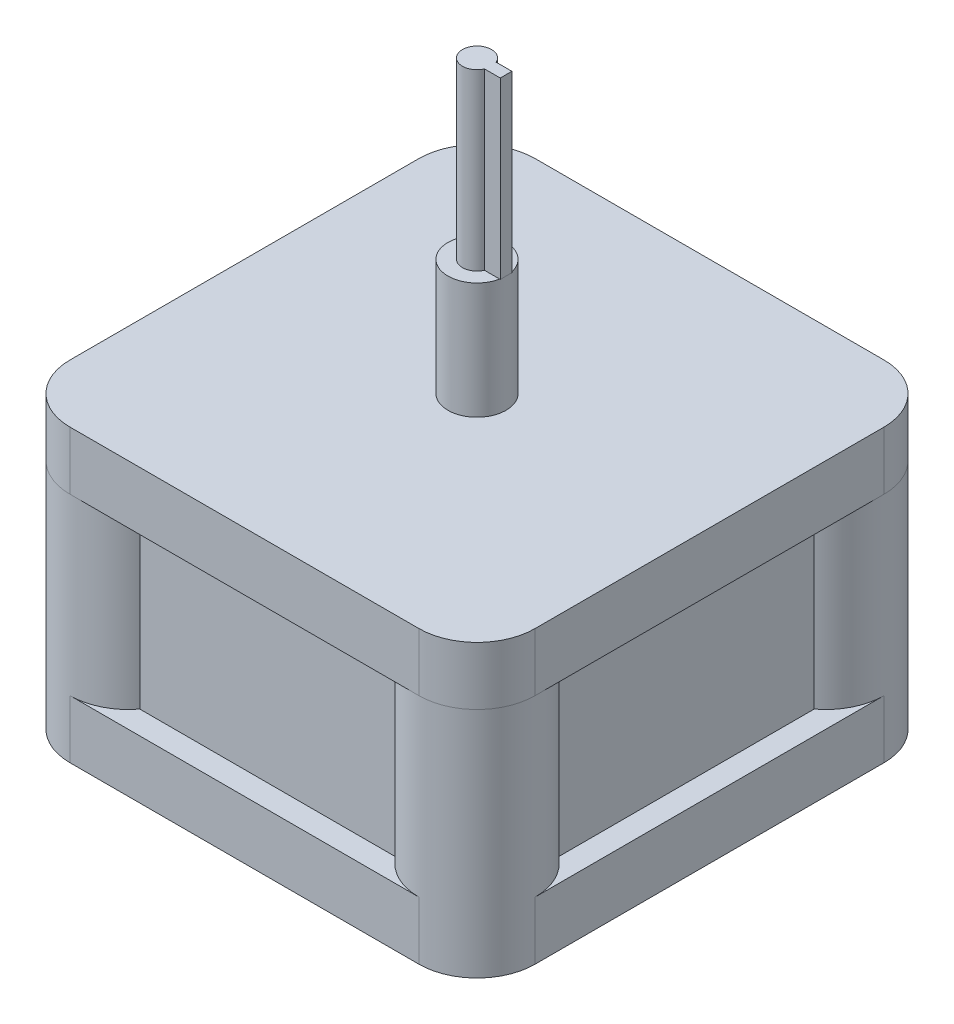
ISO-10303-21;
HEADER;
FILE_DESCRIPTION(('STEP AP214'),'2;1');
FILE_NAME('part.step','',(''),(''),'','','');
FILE_SCHEMA(('AUTOMOTIVE_DESIGN { 1 0 10303 214 1 1 1 1 }'));
ENDSEC;
DATA;
#1=APPLICATION_CONTEXT('core data for automotive mechanical design processes');
#2=APPLICATION_PROTOCOL_DEFINITION('international standard','automotive_design',2000,#1);
#3=PRODUCT_CONTEXT('',#1,'mechanical');
#4=PRODUCT('Part','Part','',(#3));
#5=PRODUCT_RELATED_PRODUCT_CATEGORY('part','',(#4));
#6=PRODUCT_DEFINITION_FORMATION('','',#4);
#7=PRODUCT_DEFINITION_CONTEXT('part definition',#1,'design');
#8=PRODUCT_DEFINITION('design','',#6,#7);
#9=PRODUCT_DEFINITION_SHAPE('','',#8);
#10=(LENGTH_UNIT() NAMED_UNIT(*) SI_UNIT(.MILLI.,.METRE.));
#11=(NAMED_UNIT(*) PLANE_ANGLE_UNIT() SI_UNIT($,.RADIAN.));
#12=(NAMED_UNIT(*) SI_UNIT($,.STERADIAN.) SOLID_ANGLE_UNIT());
#13=UNCERTAINTY_MEASURE_WITH_UNIT(LENGTH_MEASURE(1.E-05),#10,'distance_accuracy_value','');
#14=(GEOMETRIC_REPRESENTATION_CONTEXT(3) GLOBAL_UNCERTAINTY_ASSIGNED_CONTEXT((#13)) GLOBAL_UNIT_ASSIGNED_CONTEXT((#10,
#11,#12)) REPRESENTATION_CONTEXT('',''));
#15=CARTESIAN_POINT('',(0.,0.,0.));
#16=DIRECTION('',(0.,0.,1.));
#17=DIRECTION('',(1.,0.,0.));
#18=AXIS2_PLACEMENT_3D('',#15,#16,#17);
#19=CARTESIAN_POINT('',(0.,6.35,0.));
#20=DIRECTION('',(0.,-1.,0.));
#21=DIRECTION('',(0.,0.,-1.));
#22=AXIS2_PLACEMENT_3D('',#19,#20,#21);
#23=PLANE('',#22);
#24=CARTESIAN_POINT('',(44.45,6.35,-44.45));
#25=DIRECTION('',(0.,1.,0.));
#26=DIRECTION('',(0.,0.,1.));
#27=AXIS2_PLACEMENT_3D('',#24,#25,#26);
#28=CIRCLE('',#27,6.35);
#29=CARTESIAN_POINT('',(48.26,6.35,-39.37));
#30=VERTEX_POINT('',#29);
#31=CARTESIAN_POINT('',(50.8,6.35,-44.45));
#32=VERTEX_POINT('',#31);
#33=EDGE_CURVE('E296',#30,#32,#28,.T.);
#34=ORIENTED_EDGE('',*,*,#33,.F.);
#35=DIRECTION('',(0.,0.,-1.));
#36=VECTOR('',#35,1.);
#37=CARTESIAN_POINT('',(48.26,6.35,-39.37));
#38=LINE('',#37,#36);
#39=CARTESIAN_POINT('',(48.26,6.35,-11.43));
#40=VERTEX_POINT('',#39);
#41=EDGE_CURVE('E382',#40,#30,#38,.T.);
#42=ORIENTED_EDGE('',*,*,#41,.F.);
#43=CARTESIAN_POINT('',(44.45,6.35,-6.35));
#44=DIRECTION('',(0.,1.,0.));
#45=DIRECTION('',(0.,0.,1.));
#46=AXIS2_PLACEMENT_3D('',#43,#44,#45);
#47=CIRCLE('',#46,6.35);
#48=CARTESIAN_POINT('',(50.8,6.35,-6.35));
#49=VERTEX_POINT('',#48);
#50=EDGE_CURVE('E383',#49,#40,#47,.T.);
#51=ORIENTED_EDGE('',*,*,#50,.F.);
#52=DIRECTION('',(0.,0.,-1.));
#53=VECTOR('',#52,1.);
#54=CARTESIAN_POINT('',(50.8,6.35,0.));
#55=LINE('',#54,#53);
#56=EDGE_CURVE('E428',#49,#32,#55,.T.);
#57=ORIENTED_EDGE('',*,*,#56,.T.);
#58=EDGE_LOOP('',(#34,#42,#51,#57));
#59=FACE_BOUND('',#58,.T.);
#60=ADVANCED_FACE('F43',(#59),#23,.F.);
#61=CARTESIAN_POINT('',(39.37,6.35,-2.54));
#62=VERTEX_POINT('',#61);
#63=CARTESIAN_POINT('',(44.45,6.35,0.));
#64=VERTEX_POINT('',#63);
#65=EDGE_CURVE('E378',#62,#64,#47,.T.);
#66=ORIENTED_EDGE('',*,*,#65,.F.);
#67=DIRECTION('',(1.,0.,0.));
#68=VECTOR('',#67,1.);
#69=CARTESIAN_POINT('',(11.43,6.35,-2.54));
#70=LINE('',#69,#68);
#71=CARTESIAN_POINT('',(11.43,6.35,-2.54));
#72=VERTEX_POINT('',#71);
#73=EDGE_CURVE('E373',#72,#62,#70,.T.);
#74=ORIENTED_EDGE('',*,*,#73,.F.);
#75=CARTESIAN_POINT('',(6.35,6.35,-6.35));
#76=DIRECTION('',(0.,1.,0.));
#77=DIRECTION('',(0.,0.,1.));
#78=AXIS2_PLACEMENT_3D('',#75,#76,#77);
#79=CIRCLE('',#78,6.35);
#80=CARTESIAN_POINT('',(6.35,6.35,0.));
#81=VERTEX_POINT('',#80);
#82=EDGE_CURVE('E374',#81,#72,#79,.T.);
#83=ORIENTED_EDGE('',*,*,#82,.F.);
#84=DIRECTION('',(1.,0.,0.));
#85=VECTOR('',#84,1.);
#86=CARTESIAN_POINT('',(0.,6.35,0.));
#87=LINE('',#86,#85);
#88=EDGE_CURVE('E423',#81,#64,#87,.T.);
#89=ORIENTED_EDGE('',*,*,#88,.T.);
#90=EDGE_LOOP('',(#66,#74,#83,#89));
#91=FACE_BOUND('',#90,.T.);
#92=ADVANCED_FACE('F625',(#91),#23,.F.);
#93=CARTESIAN_POINT('',(2.54,6.35,-11.43));
#94=VERTEX_POINT('',#93);
#95=CARTESIAN_POINT('',(0.,6.35,-6.35));
#96=VERTEX_POINT('',#95);
#97=EDGE_CURVE('E369',#94,#96,#79,.T.);
#98=ORIENTED_EDGE('',*,*,#97,.F.);
#99=DIRECTION('',(0.,0.,1.));
#100=VECTOR('',#99,1.);
#101=CARTESIAN_POINT('',(2.54,6.35,-39.37));
#102=LINE('',#101,#100);
#103=CARTESIAN_POINT('',(2.54,6.35,-39.37));
#104=VERTEX_POINT('',#103);
#105=EDGE_CURVE('E364',#104,#94,#102,.T.);
#106=ORIENTED_EDGE('',*,*,#105,.F.);
#107=CARTESIAN_POINT('',(6.35,6.35,-44.45));
#108=DIRECTION('',(0.,1.,0.));
#109=DIRECTION('',(0.,0.,1.));
#110=AXIS2_PLACEMENT_3D('',#107,#108,#109);
#111=CIRCLE('',#110,6.35);
#112=CARTESIAN_POINT('',(0.,6.35,-44.45));
#113=VERTEX_POINT('',#112);
#114=EDGE_CURVE('E365',#113,#104,#111,.T.);
#115=ORIENTED_EDGE('',*,*,#114,.F.);
#116=DIRECTION('',(0.,0.,1.));
#117=VECTOR('',#116,1.);
#118=CARTESIAN_POINT('',(0.,6.35,0.));
#119=LINE('',#118,#117);
#120=EDGE_CURVE('E419',#113,#96,#119,.T.);
#121=ORIENTED_EDGE('',*,*,#120,.T.);
#122=EDGE_LOOP('',(#98,#106,#115,#121));
#123=FACE_BOUND('',#122,.T.);
#124=ADVANCED_FACE('F643',(#123),#23,.F.);
#125=CARTESIAN_POINT('',(44.45,6.35,-50.8));
#126=VERTEX_POINT('',#125);
#127=CARTESIAN_POINT('',(39.37,6.35,-48.26));
#128=VERTEX_POINT('',#127);
#129=EDGE_CURVE('E356',#126,#128,#28,.T.);
#130=ORIENTED_EDGE('',*,*,#129,.F.);
#131=DIRECTION('',(-1.,0.,0.));
#132=VECTOR('',#131,1.);
#133=CARTESIAN_POINT('',(0.,6.35,-50.8));
#134=LINE('',#133,#132);
#135=CARTESIAN_POINT('',(6.35,6.35,-50.8));
#136=VERTEX_POINT('',#135);
#137=EDGE_CURVE('E432',#126,#136,#134,.T.);
#138=ORIENTED_EDGE('',*,*,#137,.T.);
#139=CARTESIAN_POINT('',(11.43,6.35,-48.26));
#140=VERTEX_POINT('',#139);
#141=EDGE_CURVE('E360',#140,#136,#111,.T.);
#142=ORIENTED_EDGE('',*,*,#141,.F.);
#143=DIRECTION('',(-1.,0.,0.));
#144=VECTOR('',#143,1.);
#145=CARTESIAN_POINT('',(11.43,6.35,-48.26));
#146=LINE('',#145,#144);
#147=EDGE_CURVE('E355',#128,#140,#146,.T.);
#148=ORIENTED_EDGE('',*,*,#147,.F.);
#149=EDGE_LOOP('',(#130,#138,#142,#148));
#150=FACE_BOUND('',#149,.T.);
#151=ADVANCED_FACE('F641',(#150),#23,.F.);
#152=CARTESIAN_POINT('',(0.,6.35,0.));
#153=DIRECTION('',(1.,0.,0.));
#154=DIRECTION('',(0.,0.,-1.));
#155=AXIS2_PLACEMENT_3D('',#152,#153,#154);
#156=PLANE('',#155);
#157=ORIENTED_EDGE('',*,*,#120,.F.);
#158=DIRECTION('',(0.,-1.,0.));
#159=VECTOR('',#158,1.);
#160=CARTESIAN_POINT('',(0.,6.35,-44.45));
#161=LINE('',#160,#159);
#162=CARTESIAN_POINT('',(0.,0.,-44.45));
#163=VERTEX_POINT('',#162);
#164=EDGE_CURVE('E453',#113,#163,#161,.T.);
#165=ORIENTED_EDGE('',*,*,#164,.T.);
#166=DIRECTION('',(0.,0.,1.));
#167=VECTOR('',#166,1.);
#168=CARTESIAN_POINT('',(0.,0.,0.));
#169=LINE('',#168,#167);
#170=CARTESIAN_POINT('',(0.,0.,-6.35));
#171=VERTEX_POINT('',#170);
#172=EDGE_CURVE('E418',#163,#171,#169,.T.);
#173=ORIENTED_EDGE('',*,*,#172,.T.);
#174=DIRECTION('',(0.,-1.,0.));
#175=VECTOR('',#174,1.);
#176=CARTESIAN_POINT('',(0.,6.35,-6.35));
#177=LINE('',#176,#175);
#178=EDGE_CURVE('E436',#171,#96,#177,.F.);
#179=ORIENTED_EDGE('',*,*,#178,.T.);
#180=EDGE_LOOP('',(#157,#165,#173,#179));
#181=FACE_BOUND('',#180,.T.);
#182=ADVANCED_FACE('F636',(#181),#156,.F.);
#183=CARTESIAN_POINT('',(0.,6.35,0.));
#184=DIRECTION('',(0.,0.,-1.));
#185=DIRECTION('',(-1.,0.,0.));
#186=AXIS2_PLACEMENT_3D('',#183,#184,#185);
#187=PLANE('',#186);
#188=DIRECTION('',(1.,0.,0.));
#189=VECTOR('',#188,1.);
#190=CARTESIAN_POINT('',(0.,0.,0.));
#191=LINE('',#190,#189);
#192=CARTESIAN_POINT('',(6.35,0.,0.));
#193=VERTEX_POINT('',#192);
#194=CARTESIAN_POINT('',(44.45,0.,0.));
#195=VERTEX_POINT('',#194);
#196=EDGE_CURVE('E440',#193,#195,#191,.T.);
#197=ORIENTED_EDGE('',*,*,#196,.T.);
#198=DIRECTION('',(0.,-1.,0.));
#199=VECTOR('',#198,1.);
#200=CARTESIAN_POINT('',(44.45,6.35,0.));
#201=LINE('',#200,#199);
#202=EDGE_CURVE('E487',#195,#64,#201,.F.);
#203=ORIENTED_EDGE('',*,*,#202,.T.);
#204=ORIENTED_EDGE('',*,*,#88,.F.);
#205=DIRECTION('',(0.,-1.,0.));
#206=VECTOR('',#205,1.);
#207=CARTESIAN_POINT('',(6.35,6.35,0.));
#208=LINE('',#207,#206);
#209=EDGE_CURVE('E483',#81,#193,#208,.T.);
#210=ORIENTED_EDGE('',*,*,#209,.T.);
#211=EDGE_LOOP('',(#197,#203,#204,#210));
#212=FACE_BOUND('',#211,.T.);
#213=ADVANCED_FACE('F628',(#212),#187,.F.);
#214=CARTESIAN_POINT('',(50.8,6.35,0.));
#215=DIRECTION('',(-1.,0.,0.));
#216=DIRECTION('',(0.,0.,1.));
#217=AXIS2_PLACEMENT_3D('',#214,#215,#216);
#218=PLANE('',#217);
#219=DIRECTION('',(0.,0.,-1.));
#220=VECTOR('',#219,1.);
#221=CARTESIAN_POINT('',(50.8,0.,0.));
#222=LINE('',#221,#220);
#223=CARTESIAN_POINT('',(50.8,0.,-6.35));
#224=VERTEX_POINT('',#223);
#225=CARTESIAN_POINT('',(50.8,0.,-44.45));
#226=VERTEX_POINT('',#225);
#227=EDGE_CURVE('E444',#224,#226,#222,.T.);
#228=ORIENTED_EDGE('',*,*,#227,.T.);
#229=DIRECTION('',(0.,-1.,0.));
#230=VECTOR('',#229,1.);
#231=CARTESIAN_POINT('',(50.8,6.35,-44.45));
#232=LINE('',#231,#230);
#233=EDGE_CURVE('E480',#226,#32,#232,.F.);
#234=ORIENTED_EDGE('',*,*,#233,.T.);
#235=ORIENTED_EDGE('',*,*,#56,.F.);
#236=DIRECTION('',(0.,-1.,0.));
#237=VECTOR('',#236,1.);
#238=CARTESIAN_POINT('',(50.8,6.35,-6.35));
#239=LINE('',#238,#237);
#240=EDGE_CURVE('E476',#49,#224,#239,.T.);
#241=ORIENTED_EDGE('',*,*,#240,.T.);
#242=EDGE_LOOP('',(#228,#234,#235,#241));
#243=FACE_BOUND('',#242,.T.);
#244=ADVANCED_FACE('F684',(#243),#218,.F.);
#245=CARTESIAN_POINT('',(0.,6.35,-50.8));
#246=DIRECTION('',(0.,0.,1.));
#247=DIRECTION('',(1.,0.,0.));
#248=AXIS2_PLACEMENT_3D('',#245,#246,#247);
#249=PLANE('',#248);
#250=DIRECTION('',(-1.,0.,0.));
#251=VECTOR('',#250,1.);
#252=CARTESIAN_POINT('',(0.,0.,-50.8));
#253=LINE('',#252,#251);
#254=CARTESIAN_POINT('',(44.45,0.,-50.8));
#255=VERTEX_POINT('',#254);
#256=CARTESIAN_POINT('',(6.35,0.,-50.8));
#257=VERTEX_POINT('',#256);
#258=EDGE_CURVE('E424',#255,#257,#253,.T.);
#259=ORIENTED_EDGE('',*,*,#258,.T.);
#260=DIRECTION('',(0.,-1.,0.));
#261=VECTOR('',#260,1.);
#262=CARTESIAN_POINT('',(6.35,6.35,-50.8));
#263=LINE('',#262,#261);
#264=EDGE_CURVE('E473',#257,#136,#263,.F.);
#265=ORIENTED_EDGE('',*,*,#264,.T.);
#266=ORIENTED_EDGE('',*,*,#137,.F.);
#267=DIRECTION('',(0.,-1.,0.));
#268=VECTOR('',#267,1.);
#269=CARTESIAN_POINT('',(44.45,6.35,-50.8));
#270=LINE('',#269,#268);
#271=EDGE_CURVE('E469',#126,#255,#270,.T.);
#272=ORIENTED_EDGE('',*,*,#271,.T.);
#273=EDGE_LOOP('',(#259,#265,#266,#272));
#274=FACE_BOUND('',#273,.T.);
#275=ADVANCED_FACE('F640',(#274),#249,.F.);
#276=CARTESIAN_POINT('',(0.,0.,0.));
#277=DIRECTION('',(0.,-1.,0.));
#278=DIRECTION('',(0.,0.,-1.));
#279=AXIS2_PLACEMENT_3D('',#276,#277,#278);
#280=PLANE('',#279);
#281=ORIENTED_EDGE('',*,*,#172,.F.);
#282=CARTESIAN_POINT('',(6.35,0.,-44.45));
#283=DIRECTION('',(0.,-1.,0.));
#284=DIRECTION('',(0.,0.,-1.));
#285=AXIS2_PLACEMENT_3D('',#282,#283,#284);
#286=CIRCLE('',#285,6.35);
#287=EDGE_CURVE('E466',#163,#257,#286,.T.);
#288=ORIENTED_EDGE('',*,*,#287,.T.);
#289=ORIENTED_EDGE('',*,*,#258,.F.);
#290=CARTESIAN_POINT('',(44.45,0.,-44.45));
#291=DIRECTION('',(0.,-1.,0.));
#292=DIRECTION('',(0.,0.,-1.));
#293=AXIS2_PLACEMENT_3D('',#290,#291,#292);
#294=CIRCLE('',#293,6.35);
#295=EDGE_CURVE('E463',#255,#226,#294,.T.);
#296=ORIENTED_EDGE('',*,*,#295,.T.);
#297=ORIENTED_EDGE('',*,*,#227,.F.);
#298=CARTESIAN_POINT('',(44.45,0.,-6.35));
#299=DIRECTION('',(0.,-1.,0.));
#300=DIRECTION('',(0.,0.,-1.));
#301=AXIS2_PLACEMENT_3D('',#298,#299,#300);
#302=CIRCLE('',#301,6.35);
#303=EDGE_CURVE('E460',#224,#195,#302,.T.);
#304=ORIENTED_EDGE('',*,*,#303,.T.);
#305=ORIENTED_EDGE('',*,*,#196,.F.);
#306=CARTESIAN_POINT('',(6.35,0.,-6.35));
#307=DIRECTION('',(0.,-1.,0.));
#308=DIRECTION('',(0.,0.,-1.));
#309=AXIS2_PLACEMENT_3D('',#306,#307,#308);
#310=CIRCLE('',#309,6.35);
#311=EDGE_CURVE('E457',#193,#171,#310,.T.);
#312=ORIENTED_EDGE('',*,*,#311,.T.);
#313=EDGE_LOOP('',(#281,#288,#289,#296,#297,#304,#305,#312));
#314=FACE_BOUND('',#313,.T.);
#315=ADVANCED_FACE('F633',(#314),#280,.T.);
#316=CARTESIAN_POINT('',(6.35,6.35,-44.45));
#317=DIRECTION('',(0.,-1.,0.));
#318=DIRECTION('',(0.,0.,-1.));
#319=AXIS2_PLACEMENT_3D('',#316,#317,#318);
#320=CYLINDRICAL_SURFACE('',#319,6.35);
#321=ORIENTED_EDGE('',*,*,#164,.F.);
#322=ORIENTED_EDGE('',*,*,#114,.T.);
#323=DIRECTION('',(0.,-1.,0.));
#324=VECTOR('',#323,1.);
#325=CARTESIAN_POINT('',(2.54,25.4,-39.37));
#326=LINE('',#325,#324);
#327=CARTESIAN_POINT('',(2.54,25.4,-39.37));
#328=VERTEX_POINT('',#327);
#329=EDGE_CURVE('E406',#328,#104,#326,.T.);
#330=ORIENTED_EDGE('',*,*,#329,.F.);
#331=CARTESIAN_POINT('',(6.35,25.4,-44.45));
#332=DIRECTION('',(0.,1.,0.));
#333=DIRECTION('',(0.,0.,1.));
#334=AXIS2_PLACEMENT_3D('',#331,#332,#333);
#335=CIRCLE('',#334,6.35);
#336=CARTESIAN_POINT('',(0.,25.4,-44.45));
#337=VERTEX_POINT('',#336);
#338=EDGE_CURVE('E321',#337,#328,#335,.T.);
#339=ORIENTED_EDGE('',*,*,#338,.F.);
#340=CARTESIAN_POINT('',(6.35,25.4,-50.8));
#341=VERTEX_POINT('',#340);
#342=EDGE_CURVE('E327',#341,#337,#335,.T.);
#343=ORIENTED_EDGE('',*,*,#342,.F.);
#344=CARTESIAN_POINT('',(11.43,25.4,-48.26));
#345=VERTEX_POINT('',#344);
#346=EDGE_CURVE('E322',#345,#341,#335,.T.);
#347=ORIENTED_EDGE('',*,*,#346,.F.);
#348=DIRECTION('',(0.,-1.,0.));
#349=VECTOR('',#348,1.);
#350=CARTESIAN_POINT('',(11.43,25.4,-48.26));
#351=LINE('',#350,#349);
#352=EDGE_CURVE('E410',#345,#140,#351,.T.);
#353=ORIENTED_EDGE('',*,*,#352,.T.);
#354=ORIENTED_EDGE('',*,*,#141,.T.);
#355=ORIENTED_EDGE('',*,*,#264,.F.);
#356=ORIENTED_EDGE('',*,*,#287,.F.);
#357=EDGE_LOOP('',(#321,#322,#330,#339,#343,#347,#353,#354,#355,#356));
#358=FACE_BOUND('',#357,.T.);
#359=ADVANCED_FACE('F607',(#358),#320,.T.);
#360=CARTESIAN_POINT('',(44.45,6.35,-44.45));
#361=DIRECTION('',(0.,-1.,0.));
#362=DIRECTION('',(0.,0.,-1.));
#363=AXIS2_PLACEMENT_3D('',#360,#361,#362);
#364=CYLINDRICAL_SURFACE('',#363,6.35);
#365=ORIENTED_EDGE('',*,*,#271,.F.);
#366=ORIENTED_EDGE('',*,*,#129,.T.);
#367=DIRECTION('',(0.,-1.,0.));
#368=VECTOR('',#367,1.);
#369=CARTESIAN_POINT('',(39.37,25.4,-48.26));
#370=LINE('',#369,#368);
#371=CARTESIAN_POINT('',(39.37,25.4,-48.26));
#372=VERTEX_POINT('',#371);
#373=EDGE_CURVE('E414',#372,#128,#370,.T.);
#374=ORIENTED_EDGE('',*,*,#373,.F.);
#375=CARTESIAN_POINT('',(44.45,25.4,-44.45));
#376=DIRECTION('',(0.,1.,0.));
#377=DIRECTION('',(0.,0.,1.));
#378=AXIS2_PLACEMENT_3D('',#375,#376,#377);
#379=CIRCLE('',#378,6.35);
#380=CARTESIAN_POINT('',(44.45,25.4,-50.8));
#381=VERTEX_POINT('',#380);
#382=EDGE_CURVE('E317',#381,#372,#379,.T.);
#383=ORIENTED_EDGE('',*,*,#382,.F.);
#384=CARTESIAN_POINT('',(50.8,25.4,-44.45));
#385=VERTEX_POINT('',#384);
#386=EDGE_CURVE('E316',#385,#381,#379,.T.);
#387=ORIENTED_EDGE('',*,*,#386,.F.);
#388=CARTESIAN_POINT('',(48.26,25.4,-39.37));
#389=VERTEX_POINT('',#388);
#390=EDGE_CURVE('E311',#389,#385,#379,.T.);
#391=ORIENTED_EDGE('',*,*,#390,.F.);
#392=DIRECTION('',(0.,-1.,0.));
#393=VECTOR('',#392,1.);
#394=CARTESIAN_POINT('',(48.26,25.4,-39.37));
#395=LINE('',#394,#393);
#396=EDGE_CURVE('E351',#389,#30,#395,.T.);
#397=ORIENTED_EDGE('',*,*,#396,.T.);
#398=ORIENTED_EDGE('',*,*,#33,.T.);
#399=ORIENTED_EDGE('',*,*,#233,.F.);
#400=ORIENTED_EDGE('',*,*,#295,.F.);
#401=EDGE_LOOP('',(#365,#366,#374,#383,#387,#391,#397,#398,#399,#400));
#402=FACE_BOUND('',#401,.T.);
#403=ADVANCED_FACE('F559',(#402),#364,.T.);
#404=CARTESIAN_POINT('',(44.45,6.35,-6.35));
#405=DIRECTION('',(0.,-1.,0.));
#406=DIRECTION('',(0.,0.,-1.));
#407=AXIS2_PLACEMENT_3D('',#404,#405,#406);
#408=CYLINDRICAL_SURFACE('',#407,6.35);
#409=ORIENTED_EDGE('',*,*,#240,.F.);
#410=ORIENTED_EDGE('',*,*,#50,.T.);
#411=DIRECTION('',(0.,-1.,0.));
#412=VECTOR('',#411,1.);
#413=CARTESIAN_POINT('',(48.26,25.4,-11.43));
#414=LINE('',#413,#412);
#415=CARTESIAN_POINT('',(48.26,25.4,-11.43));
#416=VERTEX_POINT('',#415);
#417=EDGE_CURVE('E390',#416,#40,#414,.T.);
#418=ORIENTED_EDGE('',*,*,#417,.F.);
#419=CARTESIAN_POINT('',(44.45,25.4,-6.35));
#420=DIRECTION('',(0.,1.,0.));
#421=DIRECTION('',(0.,0.,1.));
#422=AXIS2_PLACEMENT_3D('',#419,#420,#421);
#423=CIRCLE('',#422,6.35);
#424=CARTESIAN_POINT('',(50.8,25.4,-6.35));
#425=VERTEX_POINT('',#424);
#426=EDGE_CURVE('E341',#425,#416,#423,.T.);
#427=ORIENTED_EDGE('',*,*,#426,.F.);
#428=CARTESIAN_POINT('',(44.45,25.4,0.));
#429=VERTEX_POINT('',#428);
#430=EDGE_CURVE('E347',#429,#425,#423,.T.);
#431=ORIENTED_EDGE('',*,*,#430,.F.);
#432=CARTESIAN_POINT('',(39.37,25.4,-2.54));
#433=VERTEX_POINT('',#432);
#434=EDGE_CURVE('E342',#433,#429,#423,.T.);
#435=ORIENTED_EDGE('',*,*,#434,.F.);
#436=DIRECTION('',(0.,-1.,0.));
#437=VECTOR('',#436,1.);
#438=CARTESIAN_POINT('',(39.37,25.4,-2.54));
#439=LINE('',#438,#437);
#440=EDGE_CURVE('E394',#433,#62,#439,.T.);
#441=ORIENTED_EDGE('',*,*,#440,.T.);
#442=ORIENTED_EDGE('',*,*,#65,.T.);
#443=ORIENTED_EDGE('',*,*,#202,.F.);
#444=ORIENTED_EDGE('',*,*,#303,.F.);
#445=EDGE_LOOP('',(#409,#410,#418,#427,#431,#435,#441,#442,#443,#444));
#446=FACE_BOUND('',#445,.T.);
#447=ADVANCED_FACE('F549',(#446),#408,.T.);
#448=CARTESIAN_POINT('',(6.35,6.35,-6.35));
#449=DIRECTION('',(0.,-1.,0.));
#450=DIRECTION('',(0.,0.,-1.));
#451=AXIS2_PLACEMENT_3D('',#448,#449,#450);
#452=CYLINDRICAL_SURFACE('',#451,6.35);
#453=ORIENTED_EDGE('',*,*,#209,.F.);
#454=ORIENTED_EDGE('',*,*,#82,.T.);
#455=DIRECTION('',(0.,-1.,0.));
#456=VECTOR('',#455,1.);
#457=CARTESIAN_POINT('',(11.43,25.4,-2.54));
#458=LINE('',#457,#456);
#459=CARTESIAN_POINT('',(11.43,25.4,-2.54));
#460=VERTEX_POINT('',#459);
#461=EDGE_CURVE('E398',#460,#72,#458,.T.);
#462=ORIENTED_EDGE('',*,*,#461,.F.);
#463=CARTESIAN_POINT('',(6.35,25.4,-6.35));
#464=DIRECTION('',(0.,1.,0.));
#465=DIRECTION('',(0.,0.,1.));
#466=AXIS2_PLACEMENT_3D('',#463,#464,#465);
#467=CIRCLE('',#466,6.35);
#468=CARTESIAN_POINT('',(6.35,25.4,0.));
#469=VERTEX_POINT('',#468);
#470=EDGE_CURVE('E331',#469,#460,#467,.T.);
#471=ORIENTED_EDGE('',*,*,#470,.F.);
#472=CARTESIAN_POINT('',(0.,25.4,-6.35));
#473=VERTEX_POINT('',#472);
#474=EDGE_CURVE('E337',#473,#469,#467,.T.);
#475=ORIENTED_EDGE('',*,*,#474,.F.);
#476=CARTESIAN_POINT('',(2.54,25.4,-11.43));
#477=VERTEX_POINT('',#476);
#478=EDGE_CURVE('E332',#477,#473,#467,.T.);
#479=ORIENTED_EDGE('',*,*,#478,.F.);
#480=DIRECTION('',(0.,-1.,0.));
#481=VECTOR('',#480,1.);
#482=CARTESIAN_POINT('',(2.54,25.4,-11.43));
#483=LINE('',#482,#481);
#484=EDGE_CURVE('E402',#477,#94,#483,.T.);
#485=ORIENTED_EDGE('',*,*,#484,.T.);
#486=ORIENTED_EDGE('',*,*,#97,.T.);
#487=ORIENTED_EDGE('',*,*,#178,.F.);
#488=ORIENTED_EDGE('',*,*,#311,.F.);
#489=EDGE_LOOP('',(#453,#454,#462,#471,#475,#479,#485,#486,#487,#488));
#490=FACE_BOUND('',#489,.T.);
#491=ADVANCED_FACE('F613',(#490),#452,.T.);
#492=CARTESIAN_POINT('',(11.43,25.4,-48.26));
#493=DIRECTION('',(0.,0.,1.));
#494=DIRECTION('',(1.,0.,0.));
#495=AXIS2_PLACEMENT_3D('',#492,#493,#494);
#496=PLANE('',#495);
#497=ORIENTED_EDGE('',*,*,#147,.T.);
#498=ORIENTED_EDGE('',*,*,#352,.F.);
#499=DIRECTION('',(-1.,0.,0.));
#500=VECTOR('',#499,1.);
#501=CARTESIAN_POINT('',(11.43,25.4,-48.26));
#502=LINE('',#501,#500);
#503=EDGE_CURVE('E315',#372,#345,#502,.T.);
#504=ORIENTED_EDGE('',*,*,#503,.F.);
#505=ORIENTED_EDGE('',*,*,#373,.T.);
#506=EDGE_LOOP('',(#497,#498,#504,#505));
#507=FACE_BOUND('',#506,.T.);
#508=ADVANCED_FACE('F581',(#507),#496,.F.);
#509=CARTESIAN_POINT('',(2.54,25.4,-39.37));
#510=DIRECTION('',(1.,0.,0.));
#511=DIRECTION('',(0.,0.,-1.));
#512=AXIS2_PLACEMENT_3D('',#509,#510,#511);
#513=PLANE('',#512);
#514=ORIENTED_EDGE('',*,*,#105,.T.);
#515=ORIENTED_EDGE('',*,*,#484,.F.);
#516=DIRECTION('',(0.,0.,1.));
#517=VECTOR('',#516,1.);
#518=CARTESIAN_POINT('',(2.54,25.4,-39.37));
#519=LINE('',#518,#517);
#520=EDGE_CURVE('E326',#328,#477,#519,.T.);
#521=ORIENTED_EDGE('',*,*,#520,.F.);
#522=ORIENTED_EDGE('',*,*,#329,.T.);
#523=EDGE_LOOP('',(#514,#515,#521,#522));
#524=FACE_BOUND('',#523,.T.);
#525=ADVANCED_FACE('F715',(#524),#513,.F.);
#526=CARTESIAN_POINT('',(11.43,25.4,-2.54));
#527=DIRECTION('',(0.,0.,-1.));
#528=DIRECTION('',(-1.,0.,0.));
#529=AXIS2_PLACEMENT_3D('',#526,#527,#528);
#530=PLANE('',#529);
#531=ORIENTED_EDGE('',*,*,#73,.T.);
#532=ORIENTED_EDGE('',*,*,#440,.F.);
#533=DIRECTION('',(1.,0.,0.));
#534=VECTOR('',#533,1.);
#535=CARTESIAN_POINT('',(11.43,25.4,-2.54));
#536=LINE('',#535,#534);
#537=EDGE_CURVE('E336',#460,#433,#536,.T.);
#538=ORIENTED_EDGE('',*,*,#537,.F.);
#539=ORIENTED_EDGE('',*,*,#461,.T.);
#540=EDGE_LOOP('',(#531,#532,#538,#539));
#541=FACE_BOUND('',#540,.T.);
#542=ADVANCED_FACE('F623',(#541),#530,.F.);
#543=CARTESIAN_POINT('',(48.26,25.4,-39.37));
#544=DIRECTION('',(-1.,0.,0.));
#545=DIRECTION('',(0.,0.,1.));
#546=AXIS2_PLACEMENT_3D('',#543,#544,#545);
#547=PLANE('',#546);
#548=ORIENTED_EDGE('',*,*,#41,.T.);
#549=ORIENTED_EDGE('',*,*,#396,.F.);
#550=DIRECTION('',(0.,0.,-1.));
#551=VECTOR('',#550,1.);
#552=CARTESIAN_POINT('',(48.26,25.4,-39.37));
#553=LINE('',#552,#551);
#554=EDGE_CURVE('E346',#416,#389,#553,.T.);
#555=ORIENTED_EDGE('',*,*,#554,.F.);
#556=ORIENTED_EDGE('',*,*,#417,.T.);
#557=EDGE_LOOP('',(#548,#549,#555,#556));
#558=FACE_BOUND('',#557,.T.);
#559=ADVANCED_FACE('F562',(#558),#547,.F.);
#560=CARTESIAN_POINT('',(0.,25.4,0.));
#561=DIRECTION('',(0.,1.,0.));
#562=DIRECTION('',(0.,0.,1.));
#563=AXIS2_PLACEMENT_3D('',#560,#561,#562);
#564=PLANE('',#563);
#565=ORIENTED_EDGE('',*,*,#554,.T.);
#566=ORIENTED_EDGE('',*,*,#390,.T.);
#567=DIRECTION('',(0.,0.,-1.));
#568=VECTOR('',#567,1.);
#569=CARTESIAN_POINT('',(50.8,25.4,-50.8));
#570=LINE('',#569,#568);
#571=EDGE_CURVE('E304',#425,#385,#570,.T.);
#572=ORIENTED_EDGE('',*,*,#571,.F.);
#573=ORIENTED_EDGE('',*,*,#426,.T.);
#574=EDGE_LOOP('',(#565,#566,#572,#573));
#575=FACE_BOUND('',#574,.T.);
#576=ADVANCED_FACE('F555',(#575),#564,.F.);
#577=DIRECTION('',(-1.,0.,0.));
#578=VECTOR('',#577,1.);
#579=CARTESIAN_POINT('',(0.,25.4,-50.8));
#580=LINE('',#579,#578);
#581=EDGE_CURVE('E284',#381,#341,#580,.T.);
#582=ORIENTED_EDGE('',*,*,#581,.F.);
#583=ORIENTED_EDGE('',*,*,#382,.T.);
#584=ORIENTED_EDGE('',*,*,#503,.T.);
#585=ORIENTED_EDGE('',*,*,#346,.T.);
#586=EDGE_LOOP('',(#582,#583,#584,#585));
#587=FACE_BOUND('',#586,.T.);
#588=ADVANCED_FACE('F585',(#587),#564,.F.);
#589=DIRECTION('',(0.,0.,1.));
#590=VECTOR('',#589,1.);
#591=CARTESIAN_POINT('',(0.,25.4,-50.8));
#592=LINE('',#591,#590);
#593=EDGE_CURVE('E276',#337,#473,#592,.T.);
#594=ORIENTED_EDGE('',*,*,#593,.F.);
#595=ORIENTED_EDGE('',*,*,#338,.T.);
#596=ORIENTED_EDGE('',*,*,#520,.T.);
#597=ORIENTED_EDGE('',*,*,#478,.T.);
#598=EDGE_LOOP('',(#594,#595,#596,#597));
#599=FACE_BOUND('',#598,.T.);
#600=ADVANCED_FACE('F611',(#599),#564,.F.);
#601=DIRECTION('',(1.,0.,0.));
#602=VECTOR('',#601,1.);
#603=CARTESIAN_POINT('',(0.,25.4,0.));
#604=LINE('',#603,#602);
#605=EDGE_CURVE('E300',#469,#429,#604,.T.);
#606=ORIENTED_EDGE('',*,*,#605,.F.);
#607=ORIENTED_EDGE('',*,*,#470,.T.);
#608=ORIENTED_EDGE('',*,*,#537,.T.);
#609=ORIENTED_EDGE('',*,*,#434,.T.);
#610=EDGE_LOOP('',(#606,#607,#608,#609));
#611=FACE_BOUND('',#610,.T.);
#612=ADVANCED_FACE('F619',(#611),#564,.F.);
#613=CARTESIAN_POINT('',(0.,31.75,-50.8));
#614=DIRECTION('',(1.,0.,0.));
#615=DIRECTION('',(0.,0.,-1.));
#616=AXIS2_PLACEMENT_3D('',#613,#614,#615);
#617=PLANE('',#616);
#618=DIRECTION('',(0.,0.,1.));
#619=VECTOR('',#618,1.);
#620=CARTESIAN_POINT('',(0.,31.75,-50.8));
#621=LINE('',#620,#619);
#622=CARTESIAN_POINT('',(0.,31.75,-44.45));
#623=VERTEX_POINT('',#622);
#624=CARTESIAN_POINT('',(0.,31.75,-6.35));
#625=VERTEX_POINT('',#624);
#626=EDGE_CURVE('E279',#623,#625,#621,.T.);
#627=ORIENTED_EDGE('',*,*,#626,.F.);
#628=DIRECTION('',(0.,-1.,0.));
#629=VECTOR('',#628,1.);
#630=CARTESIAN_POINT('',(0.,31.75,-44.45));
#631=LINE('',#630,#629);
#632=EDGE_CURVE('E519',#623,#337,#631,.T.);
#633=ORIENTED_EDGE('',*,*,#632,.T.);
#634=ORIENTED_EDGE('',*,*,#593,.T.);
#635=DIRECTION('',(0.,-1.,0.));
#636=VECTOR('',#635,1.);
#637=CARTESIAN_POINT('',(0.,31.75,-6.35));
#638=LINE('',#637,#636);
#639=EDGE_CURVE('E516',#473,#625,#638,.F.);
#640=ORIENTED_EDGE('',*,*,#639,.T.);
#641=EDGE_LOOP('',(#627,#633,#634,#640));
#642=FACE_BOUND('',#641,.T.);
#643=ADVANCED_FACE('F603',(#642),#617,.F.);
#644=CARTESIAN_POINT('',(0.,31.75,0.));
#645=DIRECTION('',(0.,0.,-1.));
#646=DIRECTION('',(-1.,0.,0.));
#647=AXIS2_PLACEMENT_3D('',#644,#645,#646);
#648=PLANE('',#647);
#649=ORIENTED_EDGE('',*,*,#605,.T.);
#650=DIRECTION('',(0.,-1.,0.));
#651=VECTOR('',#650,1.);
#652=CARTESIAN_POINT('',(44.45,31.75,0.));
#653=LINE('',#652,#651);
#654=CARTESIAN_POINT('',(44.45,31.75,0.));
#655=VERTEX_POINT('',#654);
#656=EDGE_CURVE('E47',#429,#655,#653,.F.);
#657=ORIENTED_EDGE('',*,*,#656,.T.);
#658=DIRECTION('',(1.,0.,0.));
#659=VECTOR('',#658,1.);
#660=CARTESIAN_POINT('',(0.,31.75,0.));
#661=LINE('',#660,#659);
#662=CARTESIAN_POINT('',(6.35,31.75,0.));
#663=VERTEX_POINT('',#662);
#664=EDGE_CURVE('E283',#663,#655,#661,.T.);
#665=ORIENTED_EDGE('',*,*,#664,.F.);
#666=DIRECTION('',(0.,-1.,0.));
#667=VECTOR('',#666,1.);
#668=CARTESIAN_POINT('',(6.35,31.75,0.));
#669=LINE('',#668,#667);
#670=EDGE_CURVE('E522',#663,#469,#669,.T.);
#671=ORIENTED_EDGE('',*,*,#670,.T.);
#672=EDGE_LOOP('',(#649,#657,#665,#671));
#673=FACE_BOUND('',#672,.T.);
#674=ADVANCED_FACE('F531',(#673),#648,.F.);
#675=CARTESIAN_POINT('',(50.8,31.75,-50.8));
#676=DIRECTION('',(-1.,0.,0.));
#677=DIRECTION('',(0.,0.,1.));
#678=AXIS2_PLACEMENT_3D('',#675,#676,#677);
#679=PLANE('',#678);
#680=ORIENTED_EDGE('',*,*,#571,.T.);
#681=DIRECTION('',(0.,-1.,0.));
#682=VECTOR('',#681,1.);
#683=CARTESIAN_POINT('',(50.8,31.75,-44.45));
#684=LINE('',#683,#682);
#685=CARTESIAN_POINT('',(50.8,31.75,-44.45));
#686=VERTEX_POINT('',#685);
#687=EDGE_CURVE('E501',#385,#686,#684,.F.);
#688=ORIENTED_EDGE('',*,*,#687,.T.);
#689=DIRECTION('',(0.,0.,-1.));
#690=VECTOR('',#689,1.);
#691=CARTESIAN_POINT('',(50.8,31.75,-50.8));
#692=LINE('',#691,#690);
#693=CARTESIAN_POINT('',(50.8,31.75,-6.35));
#694=VERTEX_POINT('',#693);
#695=EDGE_CURVE('E288',#694,#686,#692,.T.);
#696=ORIENTED_EDGE('',*,*,#695,.F.);
#697=DIRECTION('',(0.,-1.,0.));
#698=VECTOR('',#697,1.);
#699=CARTESIAN_POINT('',(50.8,31.75,-6.35));
#700=LINE('',#699,#698);
#701=EDGE_CURVE('E497',#694,#425,#700,.T.);
#702=ORIENTED_EDGE('',*,*,#701,.T.);
#703=EDGE_LOOP('',(#680,#688,#696,#702));
#704=FACE_BOUND('',#703,.T.);
#705=ADVANCED_FACE('F543',(#704),#679,.F.);
#706=CARTESIAN_POINT('',(0.,31.75,-50.8));
#707=DIRECTION('',(0.,0.,1.));
#708=DIRECTION('',(1.,0.,0.));
#709=AXIS2_PLACEMENT_3D('',#706,#707,#708);
#710=PLANE('',#709);
#711=DIRECTION('',(-1.,0.,0.));
#712=VECTOR('',#711,1.);
#713=CARTESIAN_POINT('',(0.,31.75,-50.8));
#714=LINE('',#713,#712);
#715=CARTESIAN_POINT('',(44.45,31.75,-50.8));
#716=VERTEX_POINT('',#715);
#717=CARTESIAN_POINT('',(6.35,31.75,-50.8));
#718=VERTEX_POINT('',#717);
#719=EDGE_CURVE('E292',#716,#718,#714,.T.);
#720=ORIENTED_EDGE('',*,*,#719,.F.);
#721=DIRECTION('',(0.,-1.,0.));
#722=VECTOR('',#721,1.);
#723=CARTESIAN_POINT('',(44.45,31.75,-50.8));
#724=LINE('',#723,#722);
#725=EDGE_CURVE('E493',#716,#381,#724,.T.);
#726=ORIENTED_EDGE('',*,*,#725,.T.);
#727=ORIENTED_EDGE('',*,*,#581,.T.);
#728=DIRECTION('',(0.,-1.,0.));
#729=VECTOR('',#728,1.);
#730=CARTESIAN_POINT('',(6.35,31.75,-50.8));
#731=LINE('',#730,#729);
#732=EDGE_CURVE('E490',#341,#718,#731,.F.);
#733=ORIENTED_EDGE('',*,*,#732,.T.);
#734=EDGE_LOOP('',(#720,#726,#727,#733));
#735=FACE_BOUND('',#734,.T.);
#736=ADVANCED_FACE('F594',(#735),#710,.F.);
#737=CARTESIAN_POINT('',(0.,31.75,0.));
#738=DIRECTION('',(0.,1.,0.));
#739=DIRECTION('',(0.,0.,1.));
#740=AXIS2_PLACEMENT_3D('',#737,#738,#739);
#741=PLANE('',#740);
#742=CARTESIAN_POINT('',(25.4,31.75,-25.4));
#743=DIRECTION('',(0.,1.,0.));
#744=DIRECTION('',(0.,0.,1.));
#745=AXIS2_PLACEMENT_3D('',#742,#743,#744);
#746=CIRCLE('',#745,3.175);
#747=CARTESIAN_POINT('',(25.4,31.75,-22.225));
#748=VERTEX_POINT('',#747);
#749=EDGE_CURVE('E262',#748,#748,#746,.T.);
#750=ORIENTED_EDGE('',*,*,#749,.F.);
#751=EDGE_LOOP('',(#750));
#752=FACE_BOUND('',#751,.T.);
#753=ORIENTED_EDGE('',*,*,#695,.T.);
#754=CARTESIAN_POINT('',(44.45,31.75,-44.45));
#755=DIRECTION('',(0.,1.,0.));
#756=DIRECTION('',(0.,0.,1.));
#757=AXIS2_PLACEMENT_3D('',#754,#755,#756);
#758=CIRCLE('',#757,6.35);
#759=EDGE_CURVE('E513',#686,#716,#758,.T.);
#760=ORIENTED_EDGE('',*,*,#759,.T.);
#761=ORIENTED_EDGE('',*,*,#719,.T.);
#762=CARTESIAN_POINT('',(6.35,31.75,-44.45));
#763=DIRECTION('',(0.,1.,0.));
#764=DIRECTION('',(0.,0.,1.));
#765=AXIS2_PLACEMENT_3D('',#762,#763,#764);
#766=CIRCLE('',#765,6.35);
#767=EDGE_CURVE('E510',#718,#623,#766,.T.);
#768=ORIENTED_EDGE('',*,*,#767,.T.);
#769=ORIENTED_EDGE('',*,*,#626,.T.);
#770=CARTESIAN_POINT('',(6.35,31.75,-6.35));
#771=DIRECTION('',(0.,1.,0.));
#772=DIRECTION('',(0.,0.,1.));
#773=AXIS2_PLACEMENT_3D('',#770,#771,#772);
#774=CIRCLE('',#773,6.35);
#775=EDGE_CURVE('E504',#625,#663,#774,.T.);
#776=ORIENTED_EDGE('',*,*,#775,.T.);
#777=ORIENTED_EDGE('',*,*,#664,.T.);
#778=CARTESIAN_POINT('',(44.45,31.75,-6.35));
#779=DIRECTION('',(0.,1.,0.));
#780=DIRECTION('',(0.,0.,1.));
#781=AXIS2_PLACEMENT_3D('',#778,#779,#780);
#782=CIRCLE('',#781,6.35);
#783=EDGE_CURVE('E507',#655,#694,#782,.T.);
#784=ORIENTED_EDGE('',*,*,#783,.T.);
#785=EDGE_LOOP('',(#753,#760,#761,#768,#769,#776,#777,#784));
#786=FACE_BOUND('',#785,.T.);
#787=ADVANCED_FACE('F536',(#752,#786),#741,.T.);
#788=CARTESIAN_POINT('',(44.45,31.75,-44.45));
#789=DIRECTION('',(0.,-1.,0.));
#790=DIRECTION('',(0.,0.,-1.));
#791=AXIS2_PLACEMENT_3D('',#788,#789,#790);
#792=CYLINDRICAL_SURFACE('',#791,6.35);
#793=ORIENTED_EDGE('',*,*,#759,.F.);
#794=ORIENTED_EDGE('',*,*,#687,.F.);
#795=ORIENTED_EDGE('',*,*,#386,.T.);
#796=ORIENTED_EDGE('',*,*,#725,.F.);
#797=EDGE_LOOP('',(#793,#794,#795,#796));
#798=FACE_BOUND('',#797,.T.);
#799=ADVANCED_FACE('F591',(#798),#792,.T.);
#800=CARTESIAN_POINT('',(6.35,31.75,-44.45));
#801=DIRECTION('',(0.,-1.,0.));
#802=DIRECTION('',(0.,0.,-1.));
#803=AXIS2_PLACEMENT_3D('',#800,#801,#802);
#804=CYLINDRICAL_SURFACE('',#803,6.35);
#805=ORIENTED_EDGE('',*,*,#767,.F.);
#806=ORIENTED_EDGE('',*,*,#732,.F.);
#807=ORIENTED_EDGE('',*,*,#342,.T.);
#808=ORIENTED_EDGE('',*,*,#632,.F.);
#809=EDGE_LOOP('',(#805,#806,#807,#808));
#810=FACE_BOUND('',#809,.T.);
#811=ADVANCED_FACE('F600',(#810),#804,.T.);
#812=CARTESIAN_POINT('',(44.45,31.75,-6.35));
#813=DIRECTION('',(0.,-1.,0.));
#814=DIRECTION('',(0.,0.,-1.));
#815=AXIS2_PLACEMENT_3D('',#812,#813,#814);
#816=CYLINDRICAL_SURFACE('',#815,6.35);
#817=ORIENTED_EDGE('',*,*,#783,.F.);
#818=ORIENTED_EDGE('',*,*,#656,.F.);
#819=ORIENTED_EDGE('',*,*,#430,.T.);
#820=ORIENTED_EDGE('',*,*,#701,.F.);
#821=EDGE_LOOP('',(#817,#818,#819,#820));
#822=FACE_BOUND('',#821,.T.);
#823=ADVANCED_FACE('F540',(#822),#816,.T.);
#824=CARTESIAN_POINT('',(6.35,31.75,-6.35));
#825=DIRECTION('',(0.,-1.,0.));
#826=DIRECTION('',(0.,0.,-1.));
#827=AXIS2_PLACEMENT_3D('',#824,#825,#826);
#828=CYLINDRICAL_SURFACE('',#827,6.35);
#829=ORIENTED_EDGE('',*,*,#775,.F.);
#830=ORIENTED_EDGE('',*,*,#639,.F.);
#831=ORIENTED_EDGE('',*,*,#474,.T.);
#832=ORIENTED_EDGE('',*,*,#670,.F.);
#833=EDGE_LOOP('',(#829,#830,#831,#832));
#834=FACE_BOUND('',#833,.T.);
#835=ADVANCED_FACE('F45',(#834),#828,.T.);
#836=CARTESIAN_POINT('',(25.4,44.45,-25.4));
#837=DIRECTION('',(0.,-1.,0.));
#838=DIRECTION('',(0.,0.,-1.));
#839=AXIS2_PLACEMENT_3D('',#836,#837,#838);
#840=CYLINDRICAL_SURFACE('',#839,3.175);
#841=CARTESIAN_POINT('',(25.4,44.45,-25.4));
#842=DIRECTION('',(0.,1.,0.));
#843=DIRECTION('',(0.,0.,1.));
#844=AXIS2_PLACEMENT_3D('',#841,#842,#843);
#845=CIRCLE('',#844,3.175);
#846=CARTESIAN_POINT('',(28.5108519733346,44.45,-24.765));
#847=VERTEX_POINT('',#846);
#848=CARTESIAN_POINT('',(28.575,44.45,-25.4));
#849=VERTEX_POINT('',#848);
#850=EDGE_CURVE('E273',#847,#849,#845,.T.);
#851=ORIENTED_EDGE('',*,*,#850,.F.);
#852=CARTESIAN_POINT('',(28.5108519733346,44.45,-26.035));
#853=VERTEX_POINT('',#852);
#854=EDGE_CURVE('E267',#853,#847,#845,.T.);
#855=ORIENTED_EDGE('',*,*,#854,.F.);
#856=EDGE_CURVE('E277',#849,#853,#845,.T.);
#857=ORIENTED_EDGE('',*,*,#856,.F.);
#858=EDGE_LOOP('',(#851,#855,#857));
#859=FACE_BOUND('',#858,.T.);
#860=ORIENTED_EDGE('',*,*,#749,.T.);
#861=EDGE_LOOP('',(#860));
#862=FACE_BOUND('',#861,.T.);
#863=ADVANCED_FACE('F886',(#859,#862),#840,.T.);
#864=CARTESIAN_POINT('',(25.4,44.45,-25.4));
#865=DIRECTION('',(0.,1.,0.));
#866=DIRECTION('',(0.,0.,1.));
#867=AXIS2_PLACEMENT_3D('',#864,#865,#866);
#868=PLANE('',#867);
#869=DIRECTION('',(-1.,0.,0.));
#870=VECTOR('',#869,1.);
#871=CARTESIAN_POINT('',(28.575,44.45,-26.035));
#872=LINE('',#871,#870);
#873=CARTESIAN_POINT('',(26.8549677831485,44.45,-26.035));
#874=VERTEX_POINT('',#873);
#875=EDGE_CURVE('E11',#853,#874,#872,.T.);
#876=ORIENTED_EDGE('',*,*,#875,.F.);
#877=ORIENTED_EDGE('',*,*,#854,.T.);
#878=DIRECTION('',(1.,0.,0.));
#879=VECTOR('',#878,1.);
#880=CARTESIAN_POINT('',(28.575,44.45,-24.765));
#881=LINE('',#880,#879);
#882=CARTESIAN_POINT('',(26.8549677831485,44.45,-24.765));
#883=VERTEX_POINT('',#882);
#884=EDGE_CURVE('E1063',#883,#847,#881,.T.);
#885=ORIENTED_EDGE('',*,*,#884,.F.);
#886=CARTESIAN_POINT('',(25.4,44.45,-25.4));
#887=DIRECTION('',(0.,1.,0.));
#888=DIRECTION('',(0.,0.,1.));
#889=AXIS2_PLACEMENT_3D('',#886,#887,#888);
#890=CIRCLE('',#889,1.5875);
#891=EDGE_CURVE('E61',#874,#883,#890,.T.);
#892=ORIENTED_EDGE('',*,*,#891,.F.);
#893=EDGE_LOOP('',(#876,#877,#885,#892));
#894=FACE_BOUND('',#893,.T.);
#895=ADVANCED_FACE('F903',(#894),#868,.T.);
#896=CARTESIAN_POINT('',(25.4,44.45,-25.4));
#897=DIRECTION('',(0.,1.,0.));
#898=DIRECTION('',(0.,0.,1.));
#899=AXIS2_PLACEMENT_3D('',#896,#897,#898);
#900=PLANE('',#899);
#901=CARTESIAN_POINT('',(28.575,44.45,-24.765));
#902=VERTEX_POINT('',#901);
#903=EDGE_CURVE('E1076',#847,#902,#881,.T.);
#904=ORIENTED_EDGE('',*,*,#903,.F.);
#905=ORIENTED_EDGE('',*,*,#850,.T.);
#906=DIRECTION('',(0.,0.,-1.));
#907=VECTOR('',#906,1.);
#908=CARTESIAN_POINT('',(28.575,44.45,-26.035));
#909=LINE('',#908,#907);
#910=EDGE_CURVE('E257',#902,#849,#909,.T.);
#911=ORIENTED_EDGE('',*,*,#910,.F.);
#912=EDGE_LOOP('',(#904,#905,#911));
#913=FACE_BOUND('',#912,.T.);
#914=ADVANCED_FACE('F914',(#913),#900,.F.);
#915=CARTESIAN_POINT('',(28.575,44.45,-26.035));
#916=VERTEX_POINT('',#915);
#917=EDGE_CURVE('E1057',#849,#916,#909,.T.);
#918=ORIENTED_EDGE('',*,*,#917,.F.);
#919=ORIENTED_EDGE('',*,*,#856,.T.);
#920=EDGE_CURVE('E54',#916,#853,#872,.T.);
#921=ORIENTED_EDGE('',*,*,#920,.F.);
#922=EDGE_LOOP('',(#918,#919,#921));
#923=FACE_BOUND('',#922,.T.);
#924=ADVANCED_FACE('F924',(#923),#900,.F.);
#925=CARTESIAN_POINT('',(28.575,63.5,-26.035));
#926=DIRECTION('',(0.,0.,1.));
#927=DIRECTION('',(1.,0.,0.));
#928=AXIS2_PLACEMENT_3D('',#925,#926,#927);
#929=PLANE('',#928);
#930=ORIENTED_EDGE('',*,*,#920,.T.);
#931=ORIENTED_EDGE('',*,*,#875,.T.);
#932=DIRECTION('',(0.,-1.,0.));
#933=VECTOR('',#932,1.);
#934=CARTESIAN_POINT('',(26.8549677831485,63.5,-26.035));
#935=LINE('',#934,#933);
#936=CARTESIAN_POINT('',(26.8549677831485,63.5,-26.035));
#937=VERTEX_POINT('',#936);
#938=EDGE_CURVE('E240',#937,#874,#935,.T.);
#939=ORIENTED_EDGE('',*,*,#938,.F.);
#940=DIRECTION('',(-1.,0.,0.));
#941=VECTOR('',#940,1.);
#942=CARTESIAN_POINT('',(28.575,63.5,-26.035));
#943=LINE('',#942,#941);
#944=CARTESIAN_POINT('',(28.575,63.5,-26.035));
#945=VERTEX_POINT('',#944);
#946=EDGE_CURVE('E247',#945,#937,#943,.T.);
#947=ORIENTED_EDGE('',*,*,#946,.F.);
#948=DIRECTION('',(0.,-1.,0.));
#949=VECTOR('',#948,1.);
#950=CARTESIAN_POINT('',(28.575,63.5,-26.035));
#951=LINE('',#950,#949);
#952=EDGE_CURVE('E1067',#945,#916,#951,.T.);
#953=ORIENTED_EDGE('',*,*,#952,.T.);
#954=EDGE_LOOP('',(#930,#931,#939,#947,#953));
#955=FACE_BOUND('',#954,.T.);
#956=ADVANCED_FACE('F260',(#955),#929,.F.);
#957=CARTESIAN_POINT('',(25.4,63.5,-25.4));
#958=DIRECTION('',(0.,-1.,0.));
#959=DIRECTION('',(0.,0.,-1.));
#960=AXIS2_PLACEMENT_3D('',#957,#958,#959);
#961=CYLINDRICAL_SURFACE('',#960,1.5875);
#962=ORIENTED_EDGE('',*,*,#891,.T.);
#963=DIRECTION('',(0.,-1.,0.));
#964=VECTOR('',#963,1.);
#965=CARTESIAN_POINT('',(26.8549677831485,63.5,-24.765));
#966=LINE('',#965,#964);
#967=CARTESIAN_POINT('',(26.8549677831485,63.5,-24.765));
#968=VERTEX_POINT('',#967);
#969=EDGE_CURVE('E242',#968,#883,#966,.T.);
#970=ORIENTED_EDGE('',*,*,#969,.F.);
#971=CARTESIAN_POINT('',(25.4,63.5,-25.4));
#972=DIRECTION('',(0.,1.,0.));
#973=DIRECTION('',(0.,0.,1.));
#974=AXIS2_PLACEMENT_3D('',#971,#972,#973);
#975=CIRCLE('',#974,1.5875);
#976=EDGE_CURVE('E236',#937,#968,#975,.T.);
#977=ORIENTED_EDGE('',*,*,#976,.F.);
#978=ORIENTED_EDGE('',*,*,#938,.T.);
#979=EDGE_LOOP('',(#962,#970,#977,#978));
#980=FACE_BOUND('',#979,.T.);
#981=ADVANCED_FACE('F238',(#980),#961,.T.);
#982=CARTESIAN_POINT('',(28.575,63.5,-24.765));
#983=DIRECTION('',(0.,0.,-1.));
#984=DIRECTION('',(-1.,0.,0.));
#985=AXIS2_PLACEMENT_3D('',#982,#983,#984);
#986=PLANE('',#985);
#987=ORIENTED_EDGE('',*,*,#884,.T.);
#988=ORIENTED_EDGE('',*,*,#903,.T.);
#989=DIRECTION('',(0.,-1.,0.));
#990=VECTOR('',#989,1.);
#991=CARTESIAN_POINT('',(28.575,63.5,-24.765));
#992=LINE('',#991,#990);
#993=CARTESIAN_POINT('',(28.575,63.5,-24.765));
#994=VERTEX_POINT('',#993);
#995=EDGE_CURVE('E269',#994,#902,#992,.T.);
#996=ORIENTED_EDGE('',*,*,#995,.F.);
#997=DIRECTION('',(1.,0.,0.));
#998=VECTOR('',#997,1.);
#999=CARTESIAN_POINT('',(28.575,63.5,-24.765));
#1000=LINE('',#999,#998);
#1001=EDGE_CURVE('E246',#968,#994,#1000,.T.);
#1002=ORIENTED_EDGE('',*,*,#1001,.F.);
#1003=ORIENTED_EDGE('',*,*,#969,.T.);
#1004=EDGE_LOOP('',(#987,#988,#996,#1002,#1003));
#1005=FACE_BOUND('',#1004,.T.);
#1006=ADVANCED_FACE('F953',(#1005),#986,.F.);
#1007=CARTESIAN_POINT('',(28.575,63.5,-26.035));
#1008=DIRECTION('',(-1.,0.,0.));
#1009=DIRECTION('',(0.,0.,1.));
#1010=AXIS2_PLACEMENT_3D('',#1007,#1008,#1009);
#1011=PLANE('',#1010);
#1012=ORIENTED_EDGE('',*,*,#910,.T.);
#1013=ORIENTED_EDGE('',*,*,#917,.T.);
#1014=ORIENTED_EDGE('',*,*,#952,.F.);
#1015=DIRECTION('',(0.,0.,-1.));
#1016=VECTOR('',#1015,1.);
#1017=CARTESIAN_POINT('',(28.575,63.5,-26.035));
#1018=LINE('',#1017,#1016);
#1019=EDGE_CURVE('E252',#994,#945,#1018,.T.);
#1020=ORIENTED_EDGE('',*,*,#1019,.F.);
#1021=ORIENTED_EDGE('',*,*,#995,.T.);
#1022=EDGE_LOOP('',(#1012,#1013,#1014,#1020,#1021));
#1023=FACE_BOUND('',#1022,.T.);
#1024=ADVANCED_FACE('F963',(#1023),#1011,.F.);
#1025=CARTESIAN_POINT('',(25.4,63.5,-25.4));
#1026=DIRECTION('',(0.,1.,0.));
#1027=DIRECTION('',(0.,0.,1.));
#1028=AXIS2_PLACEMENT_3D('',#1025,#1026,#1027);
#1029=PLANE('',#1028);
#1030=ORIENTED_EDGE('',*,*,#946,.T.);
#1031=ORIENTED_EDGE('',*,*,#976,.T.);
#1032=ORIENTED_EDGE('',*,*,#1001,.T.);
#1033=ORIENTED_EDGE('',*,*,#1019,.T.);
#1034=EDGE_LOOP('',(#1030,#1031,#1032,#1033));
#1035=FACE_BOUND('',#1034,.T.);
#1036=ADVANCED_FACE('F250',(#1035),#1029,.T.);
#1037=CLOSED_SHELL('',(#60,#92,#124,#151,#182,#213,#244,#275,#315,#359,#403,#447,#491,#508,#525,
#542,#559,#576,#588,#600,#612,#643,#674,#705,#736,#787,#799,#811,#823,#835,#863,#895,#914,#924,
#956,#981,#1006,#1024,#1036));
#1038=MANIFOLD_SOLID_BREP('B2',#1037);
#1039=ADVANCED_BREP_SHAPE_REPRESENTATION('',(#18,#1038),#14);
#1040=SHAPE_DEFINITION_REPRESENTATION(#9,#1039);
ENDSEC;
END-ISO-10303-21;
